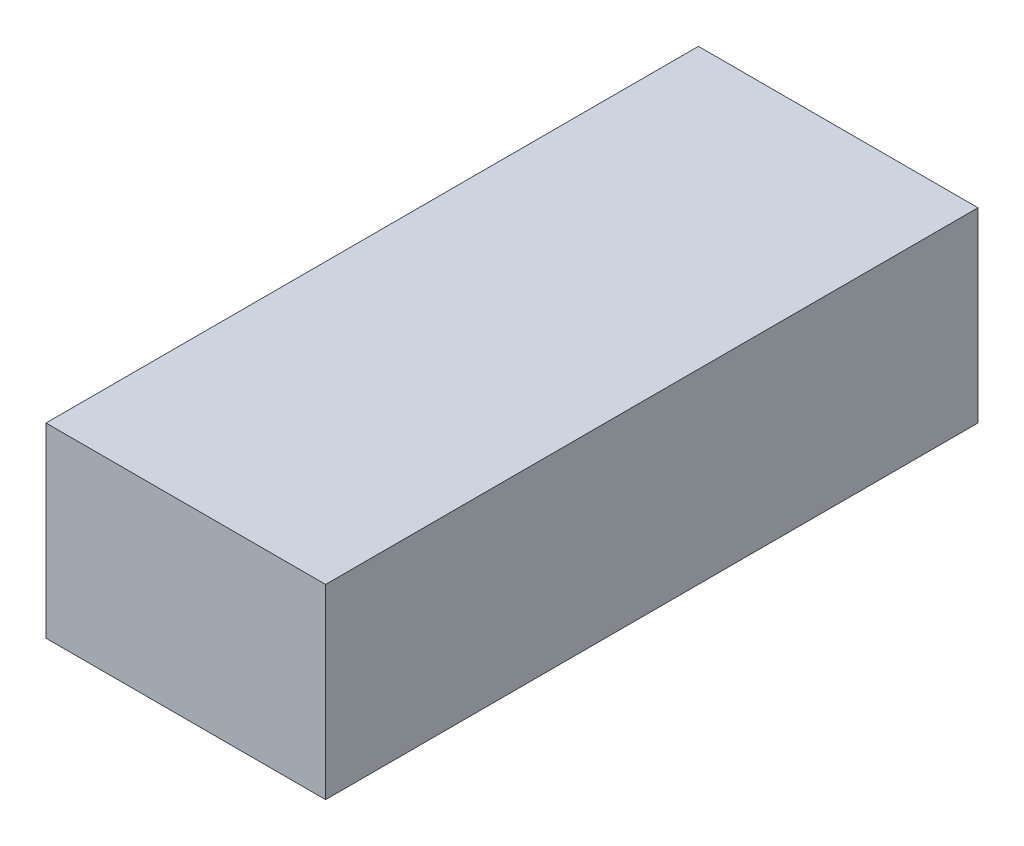
ISO-10303-21;
HEADER;
FILE_DESCRIPTION(('STEP AP214'),'2;1');
FILE_NAME('part.step','',(''),(''),'','','');
FILE_SCHEMA(('AUTOMOTIVE_DESIGN { 1 0 10303 214 1 1 1 1 }'));
ENDSEC;
DATA;
#1=APPLICATION_CONTEXT('core data for automotive mechanical design processes');
#2=APPLICATION_PROTOCOL_DEFINITION('international standard','automotive_design',2000,#1);
#3=PRODUCT_CONTEXT('',#1,'mechanical');
#4=PRODUCT('Part','Part','',(#3));
#5=PRODUCT_RELATED_PRODUCT_CATEGORY('part','',(#4));
#6=PRODUCT_DEFINITION_FORMATION('','',#4);
#7=PRODUCT_DEFINITION_CONTEXT('part definition',#1,'design');
#8=PRODUCT_DEFINITION('design','',#6,#7);
#9=PRODUCT_DEFINITION_SHAPE('','',#8);
#10=(LENGTH_UNIT() NAMED_UNIT(*) SI_UNIT(.MILLI.,.METRE.));
#11=(NAMED_UNIT(*) PLANE_ANGLE_UNIT() SI_UNIT($,.RADIAN.));
#12=(NAMED_UNIT(*) SI_UNIT($,.STERADIAN.) SOLID_ANGLE_UNIT());
#13=UNCERTAINTY_MEASURE_WITH_UNIT(LENGTH_MEASURE(1.E-05),#10,'distance_accuracy_value','');
#14=(GEOMETRIC_REPRESENTATION_CONTEXT(3) GLOBAL_UNCERTAINTY_ASSIGNED_CONTEXT((#13)) GLOBAL_UNIT_ASSIGNED_CONTEXT((#10,
#11,#12)) REPRESENTATION_CONTEXT('',''));
#15=CARTESIAN_POINT('',(0.,0.,0.));
#16=DIRECTION('',(0.,0.,1.));
#17=DIRECTION('',(1.,0.,0.));
#18=AXIS2_PLACEMENT_3D('',#15,#16,#17);
#19=CARTESIAN_POINT('',(0.,20.32,0.));
#20=DIRECTION('',(1.,0.,0.));
#21=DIRECTION('',(0.,0.,-1.));
#22=AXIS2_PLACEMENT_3D('',#19,#20,#21);
#23=PLANE('',#22);
#24=DIRECTION('',(0.,0.,1.));
#25=VECTOR('',#24,1.);
#26=CARTESIAN_POINT('',(0.,0.,0.));
#27=LINE('',#26,#25);
#28=CARTESIAN_POINT('',(0.,0.,-71.12));
#29=VERTEX_POINT('',#28);
#30=CARTESIAN_POINT('',(0.,0.,0.));
#31=VERTEX_POINT('',#30);
#32=EDGE_CURVE('E103',#29,#31,#27,.T.);
#33=ORIENTED_EDGE('',*,*,#32,.T.);
#34=DIRECTION('',(0.,-1.,0.));
#35=VECTOR('',#34,1.);
#36=CARTESIAN_POINT('',(0.,20.32,0.));
#37=LINE('',#36,#35);
#38=CARTESIAN_POINT('',(0.,20.32,0.));
#39=VERTEX_POINT('',#38);
#40=EDGE_CURVE('E11',#39,#31,#37,.T.);
#41=ORIENTED_EDGE('',*,*,#40,.F.);
#42=DIRECTION('',(0.,0.,1.));
#43=VECTOR('',#42,1.);
#44=CARTESIAN_POINT('',(0.,20.32,0.));
#45=LINE('',#44,#43);
#46=CARTESIAN_POINT('',(0.,20.32,-71.12));
#47=VERTEX_POINT('',#46);
#48=EDGE_CURVE('E91',#47,#39,#45,.T.);
#49=ORIENTED_EDGE('',*,*,#48,.F.);
#50=DIRECTION('',(0.,-1.,0.));
#51=VECTOR('',#50,1.);
#52=CARTESIAN_POINT('',(0.,20.32,-71.12));
#53=LINE('',#52,#51);
#54=EDGE_CURVE('E99',#47,#29,#53,.T.);
#55=ORIENTED_EDGE('',*,*,#54,.T.);
#56=EDGE_LOOP('',(#33,#41,#49,#55));
#57=FACE_BOUND('',#56,.T.);
#58=ADVANCED_FACE('F40',(#57),#23,.F.);
#59=CARTESIAN_POINT('',(0.,20.32,0.));
#60=DIRECTION('',(0.,0.,-1.));
#61=DIRECTION('',(-1.,0.,0.));
#62=AXIS2_PLACEMENT_3D('',#59,#60,#61);
#63=PLANE('',#62);
#64=DIRECTION('',(1.,0.,0.));
#65=VECTOR('',#64,1.);
#66=CARTESIAN_POINT('',(0.,0.,0.));
#67=LINE('',#66,#65);
#68=CARTESIAN_POINT('',(30.48,0.,0.));
#69=VERTEX_POINT('',#68);
#70=EDGE_CURVE('E95',#31,#69,#67,.T.);
#71=ORIENTED_EDGE('',*,*,#70,.T.);
#72=DIRECTION('',(0.,-1.,0.));
#73=VECTOR('',#72,1.);
#74=CARTESIAN_POINT('',(30.48,20.32,0.));
#75=LINE('',#74,#73);
#76=CARTESIAN_POINT('',(30.48,20.32,0.));
#77=VERTEX_POINT('',#76);
#78=EDGE_CURVE('E48',#77,#69,#75,.T.);
#79=ORIENTED_EDGE('',*,*,#78,.F.);
#80=DIRECTION('',(1.,0.,0.));
#81=VECTOR('',#80,1.);
#82=CARTESIAN_POINT('',(0.,20.32,0.));
#83=LINE('',#82,#81);
#84=EDGE_CURVE('E86',#39,#77,#83,.T.);
#85=ORIENTED_EDGE('',*,*,#84,.F.);
#86=ORIENTED_EDGE('',*,*,#40,.T.);
#87=EDGE_LOOP('',(#71,#79,#85,#86));
#88=FACE_BOUND('',#87,.T.);
#89=ADVANCED_FACE('F94',(#88),#63,.F.);
#90=CARTESIAN_POINT('',(30.48,20.32,0.));
#91=DIRECTION('',(-1.,0.,0.));
#92=DIRECTION('',(0.,0.,1.));
#93=AXIS2_PLACEMENT_3D('',#90,#91,#92);
#94=PLANE('',#93);
#95=DIRECTION('',(0.,0.,-1.));
#96=VECTOR('',#95,1.);
#97=CARTESIAN_POINT('',(30.48,0.,0.));
#98=LINE('',#97,#96);
#99=CARTESIAN_POINT('',(30.48,0.,-71.12));
#100=VERTEX_POINT('',#99);
#101=EDGE_CURVE('E73',#69,#100,#98,.T.);
#102=ORIENTED_EDGE('',*,*,#101,.T.);
#103=DIRECTION('',(0.,-1.,0.));
#104=VECTOR('',#103,1.);
#105=CARTESIAN_POINT('',(30.48,20.32,-71.12));
#106=LINE('',#105,#104);
#107=CARTESIAN_POINT('',(30.48,20.32,-71.12));
#108=VERTEX_POINT('',#107);
#109=EDGE_CURVE('E96',#108,#100,#106,.T.);
#110=ORIENTED_EDGE('',*,*,#109,.F.);
#111=DIRECTION('',(0.,0.,-1.));
#112=VECTOR('',#111,1.);
#113=CARTESIAN_POINT('',(30.48,20.32,0.));
#114=LINE('',#113,#112);
#115=EDGE_CURVE('E89',#77,#108,#114,.T.);
#116=ORIENTED_EDGE('',*,*,#115,.F.);
#117=ORIENTED_EDGE('',*,*,#78,.T.);
#118=EDGE_LOOP('',(#102,#110,#116,#117));
#119=FACE_BOUND('',#118,.T.);
#120=ADVANCED_FACE('F97',(#119),#94,.F.);
#121=CARTESIAN_POINT('',(0.,20.32,-71.12));
#122=DIRECTION('',(0.,0.,1.));
#123=DIRECTION('',(1.,0.,0.));
#124=AXIS2_PLACEMENT_3D('',#121,#122,#123);
#125=PLANE('',#124);
#126=DIRECTION('',(-1.,0.,0.));
#127=VECTOR('',#126,1.);
#128=CARTESIAN_POINT('',(0.,0.,-71.12));
#129=LINE('',#128,#127);
#130=EDGE_CURVE('E79',#100,#29,#129,.T.);
#131=ORIENTED_EDGE('',*,*,#130,.T.);
#132=ORIENTED_EDGE('',*,*,#54,.F.);
#133=DIRECTION('',(-1.,0.,0.));
#134=VECTOR('',#133,1.);
#135=CARTESIAN_POINT('',(0.,20.32,-71.12));
#136=LINE('',#135,#134);
#137=EDGE_CURVE('E56',#108,#47,#136,.T.);
#138=ORIENTED_EDGE('',*,*,#137,.F.);
#139=ORIENTED_EDGE('',*,*,#109,.T.);
#140=EDGE_LOOP('',(#131,#132,#138,#139));
#141=FACE_BOUND('',#140,.T.);
#142=ADVANCED_FACE('F110',(#141),#125,.F.);
#143=CARTESIAN_POINT('',(0.,20.32,0.));
#144=DIRECTION('',(0.,-1.,0.));
#145=DIRECTION('',(0.,0.,-1.));
#146=AXIS2_PLACEMENT_3D('',#143,#144,#145);
#147=PLANE('',#146);
#148=ORIENTED_EDGE('',*,*,#48,.T.);
#149=ORIENTED_EDGE('',*,*,#84,.T.);
#150=ORIENTED_EDGE('',*,*,#115,.T.);
#151=ORIENTED_EDGE('',*,*,#137,.T.);
#152=EDGE_LOOP('',(#148,#149,#150,#151));
#153=FACE_BOUND('',#152,.T.);
#154=ADVANCED_FACE('F87',(#153),#147,.F.);
#155=CARTESIAN_POINT('',(0.,0.,0.));
#156=DIRECTION('',(0.,-1.,0.));
#157=DIRECTION('',(0.,0.,-1.));
#158=AXIS2_PLACEMENT_3D('',#155,#156,#157);
#159=PLANE('',#158);
#160=ORIENTED_EDGE('',*,*,#32,.F.);
#161=ORIENTED_EDGE('',*,*,#130,.F.);
#162=ORIENTED_EDGE('',*,*,#101,.F.);
#163=ORIENTED_EDGE('',*,*,#70,.F.);
#164=EDGE_LOOP('',(#160,#161,#162,#163));
#165=FACE_BOUND('',#164,.T.);
#166=ADVANCED_FACE('F113',(#165),#159,.T.);
#167=CLOSED_SHELL('',(#58,#89,#120,#142,#154,#166));
#168=MANIFOLD_SOLID_BREP('B2',#167);
#169=ADVANCED_BREP_SHAPE_REPRESENTATION('',(#18,#168),#14);
#170=SHAPE_DEFINITION_REPRESENTATION(#9,#169);
ENDSEC;
END-ISO-10303-21;
